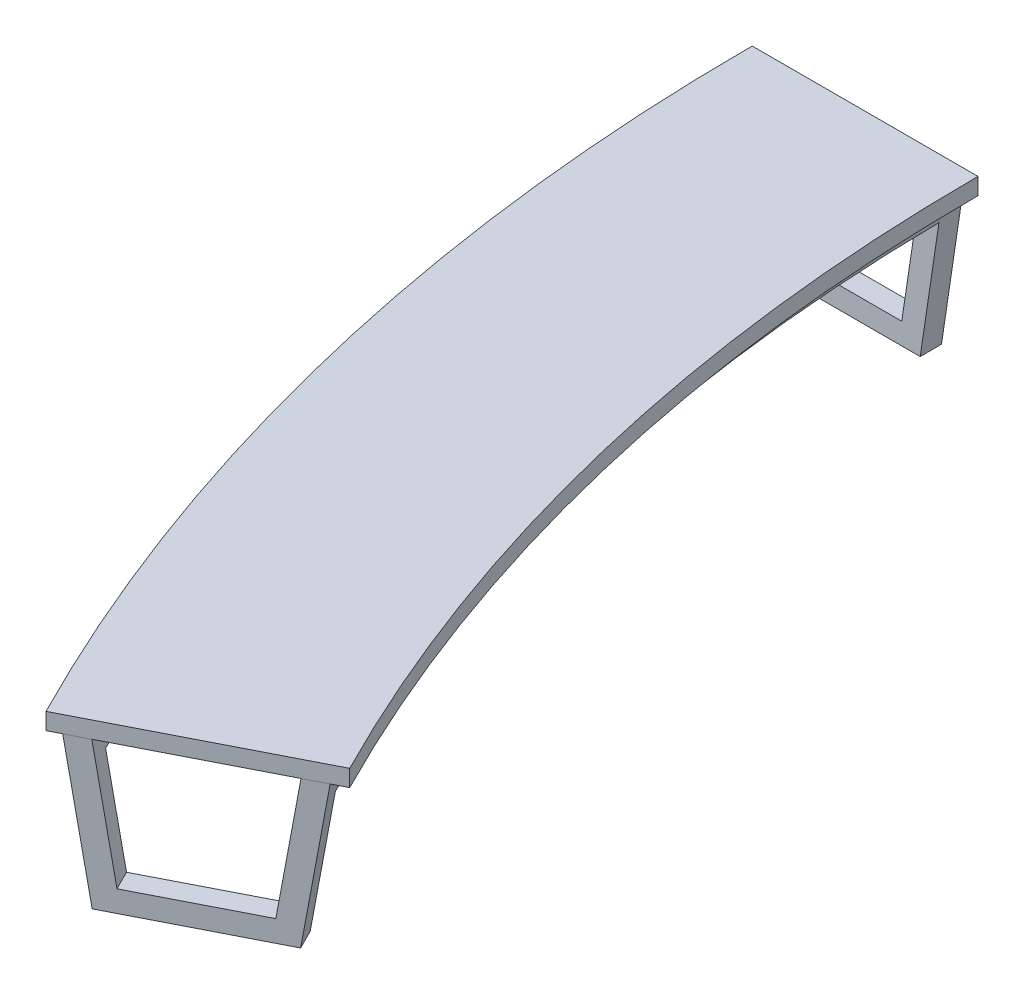
ISO-10303-21;
HEADER;
FILE_DESCRIPTION(('STEP AP214'),'2;1');
FILE_NAME('part.step','',(''),(''),'','','');
FILE_SCHEMA(('AUTOMOTIVE_DESIGN { 1 0 10303 214 1 1 1 1 }'));
ENDSEC;
DATA;
#1=APPLICATION_CONTEXT('core data for automotive mechanical design processes');
#2=APPLICATION_PROTOCOL_DEFINITION('international standard','automotive_design',2000,#1);
#3=PRODUCT_CONTEXT('',#1,'mechanical');
#4=PRODUCT('Part','Part','',(#3));
#5=PRODUCT_RELATED_PRODUCT_CATEGORY('part','',(#4));
#6=PRODUCT_DEFINITION_FORMATION('','',#4);
#7=PRODUCT_DEFINITION_CONTEXT('part definition',#1,'design');
#8=PRODUCT_DEFINITION('design','',#6,#7);
#9=PRODUCT_DEFINITION_SHAPE('','',#8);
#10=(LENGTH_UNIT() NAMED_UNIT(*) SI_UNIT(.MILLI.,.METRE.));
#11=(NAMED_UNIT(*) PLANE_ANGLE_UNIT() SI_UNIT($,.RADIAN.));
#12=(NAMED_UNIT(*) SI_UNIT($,.STERADIAN.) SOLID_ANGLE_UNIT());
#13=UNCERTAINTY_MEASURE_WITH_UNIT(LENGTH_MEASURE(1.E-05),#10,'distance_accuracy_value','');
#14=(GEOMETRIC_REPRESENTATION_CONTEXT(3) GLOBAL_UNCERTAINTY_ASSIGNED_CONTEXT((#13)) GLOBAL_UNIT_ASSIGNED_CONTEXT((#10,
#11,#12)) REPRESENTATION_CONTEXT('',''));
#15=CARTESIAN_POINT('',(0.,0.,0.));
#16=DIRECTION('',(0.,0.,1.));
#17=DIRECTION('',(1.,0.,0.));
#18=AXIS2_PLACEMENT_3D('',#15,#16,#17);
#19=CARTESIAN_POINT('',(0.,70.,0.));
#20=DIRECTION('',(0.,-1.,0.));
#21=DIRECTION('',(0.,0.,-1.));
#22=AXIS2_PLACEMENT_3D('',#19,#20,#21);
#23=CYLINDRICAL_SURFACE('',#22,6690.5465023735);
#24=CARTESIAN_POINT('',(0.,534.654813963416,0.));
#25=DIRECTION('',(0.,-1.,0.));
#26=DIRECTION('',(0.,0.,-1.));
#27=AXIS2_PLACEMENT_3D('',#24,#25,#26);
#28=CIRCLE('',#27,6690.5465023735);
#29=CARTESIAN_POINT('',(-5961.32058400045,534.654813963416,3037.44455014323));
#30=VERTEX_POINT('',#29);
#31=CARTESIAN_POINT('',(-6690.5465023735,534.654813963416,0.));
#32=VERTEX_POINT('',#31);
#33=EDGE_CURVE('E13',#30,#32,#28,.T.);
#34=ORIENTED_EDGE('',*,*,#33,.T.);
#35=DIRECTION('',(0.,1.,0.));
#36=VECTOR('',#35,1.);
#37=CARTESIAN_POINT('',(-6690.5465023735,479.999999999999,0.));
#38=LINE('',#37,#36);
#39=CARTESIAN_POINT('',(-6690.5465023735,479.999999999999,0.));
#40=VERTEX_POINT('',#39);
#41=EDGE_CURVE('E85',#40,#32,#38,.T.);
#42=ORIENTED_EDGE('',*,*,#41,.F.);
#43=CARTESIAN_POINT('',(0.,479.999999999999,0.));
#44=DIRECTION('',(0.,-1.,0.));
#45=DIRECTION('',(0.,0.,-1.));
#46=AXIS2_PLACEMENT_3D('',#43,#44,#45);
#47=CIRCLE('',#46,6690.5465023735);
#48=CARTESIAN_POINT('',(-5961.32058400045,479.999999999999,3037.44455014323));
#49=VERTEX_POINT('',#48);
#50=EDGE_CURVE('E60',#49,#40,#47,.T.);
#51=ORIENTED_EDGE('',*,*,#50,.F.);
#52=DIRECTION('',(0.,1.,0.));
#53=VECTOR('',#52,1.);
#54=CARTESIAN_POINT('',(-5961.32058400045,479.999999999999,3037.44455014323));
#55=LINE('',#54,#53);
#56=EDGE_CURVE('E87',#49,#30,#55,.T.);
#57=ORIENTED_EDGE('',*,*,#56,.T.);
#58=EDGE_LOOP('',(#34,#42,#51,#57));
#59=FACE_BOUND('',#58,.T.);
#60=ADVANCED_FACE('F45',(#59),#23,.T.);
#61=CARTESIAN_POINT('',(-5961.32058400045,534.654813963416,3037.44455014323));
#62=DIRECTION('',(0.,1.,0.));
#63=DIRECTION('',(0.,0.,1.));
#64=AXIS2_PLACEMENT_3D('',#61,#62,#63);
#65=PLANE('',#64);
#66=CARTESIAN_POINT('',(0.,534.654813963416,0.));
#67=DIRECTION('',(0.,-1.,0.));
#68=DIRECTION('',(0.,0.,-1.));
#69=AXIS2_PLACEMENT_3D('',#66,#67,#68);
#70=CIRCLE('',#69,5952.43896615089);
#71=CARTESIAN_POINT('',(-5303.6619536735,534.654813963416,2702.350740912));
#72=VERTEX_POINT('',#71);
#73=CARTESIAN_POINT('',(-5952.43896615089,534.654813963416,0.));
#74=VERTEX_POINT('',#73);
#75=EDGE_CURVE('E53',#72,#74,#70,.T.);
#76=ORIENTED_EDGE('',*,*,#75,.T.);
#77=DIRECTION('',(1.,0.,0.));
#78=VECTOR('',#77,1.);
#79=CARTESIAN_POINT('',(-6690.5465023735,534.654813963416,0.));
#80=LINE('',#79,#78);
#81=EDGE_CURVE('E96',#32,#74,#80,.T.);
#82=ORIENTED_EDGE('',*,*,#81,.F.);
#83=ORIENTED_EDGE('',*,*,#33,.F.);
#84=DIRECTION('',(0.891006524188367,0.,-0.453990499739548));
#85=VECTOR('',#84,1.);
#86=CARTESIAN_POINT('',(-5961.32058400045,534.654813963416,3037.44455014323));
#87=LINE('',#86,#85);
#88=EDGE_CURVE('E106',#30,#72,#87,.T.);
#89=ORIENTED_EDGE('',*,*,#88,.T.);
#90=EDGE_LOOP('',(#76,#82,#83,#89));
#91=FACE_BOUND('',#90,.T.);
#92=ADVANCED_FACE('F47',(#91),#65,.T.);
#93=CARTESIAN_POINT('',(0.,70.,0.));
#94=DIRECTION('',(0.,-1.,0.));
#95=DIRECTION('',(0.,0.,-1.));
#96=AXIS2_PLACEMENT_3D('',#93,#94,#95);
#97=CYLINDRICAL_SURFACE('',#96,5952.43896615089);
#98=CARTESIAN_POINT('',(0.,479.999999999999,0.));
#99=DIRECTION('',(0.,-1.,0.));
#100=DIRECTION('',(0.,0.,-1.));
#101=AXIS2_PLACEMENT_3D('',#98,#99,#100);
#102=CIRCLE('',#101,5952.43896615089);
#103=CARTESIAN_POINT('',(-5303.6619536735,479.999999999999,2702.350740912));
#104=VERTEX_POINT('',#103);
#105=CARTESIAN_POINT('',(-5952.43896615089,479.999999999999,0.));
#106=VERTEX_POINT('',#105);
#107=EDGE_CURVE('E68',#104,#106,#102,.T.);
#108=ORIENTED_EDGE('',*,*,#107,.T.);
#109=DIRECTION('',(0.,-1.,0.));
#110=VECTOR('',#109,1.);
#111=CARTESIAN_POINT('',(-5952.43896615089,479.999999999999,0.));
#112=LINE('',#111,#110);
#113=EDGE_CURVE('E100',#74,#106,#112,.T.);
#114=ORIENTED_EDGE('',*,*,#113,.F.);
#115=ORIENTED_EDGE('',*,*,#75,.F.);
#116=DIRECTION('',(0.,-1.,0.));
#117=VECTOR('',#116,1.);
#118=CARTESIAN_POINT('',(-5303.6619536735,479.999999999999,2702.350740912));
#119=LINE('',#118,#117);
#120=EDGE_CURVE('E108',#72,#104,#119,.T.);
#121=ORIENTED_EDGE('',*,*,#120,.T.);
#122=EDGE_LOOP('',(#108,#114,#115,#121));
#123=FACE_BOUND('',#122,.T.);
#124=ADVANCED_FACE('F114',(#123),#97,.F.);
#125=CARTESIAN_POINT('',(-5961.32058400045,479.999999999999,3037.44455014323));
#126=DIRECTION('',(0.,-1.,0.));
#127=DIRECTION('',(0.,0.,-1.));
#128=AXIS2_PLACEMENT_3D('',#125,#126,#127);
#129=PLANE('',#128);
#130=DIRECTION('',(-0.891006524188367,0.,0.453990499739548));
#131=VECTOR('',#130,1.);
#132=CARTESIAN_POINT('',(-5961.32058400045,479.999999999999,3037.44455014323));
#133=LINE('',#132,#131);
#134=EDGE_CURVE('E110',#104,#49,#133,.T.);
#135=ORIENTED_EDGE('',*,*,#134,.T.);
#136=ORIENTED_EDGE('',*,*,#50,.T.);
#137=DIRECTION('',(-1.,0.,0.));
#138=VECTOR('',#137,1.);
#139=CARTESIAN_POINT('',(-6690.5465023735,479.999999999999,0.));
#140=LINE('',#139,#138);
#141=EDGE_CURVE('E98',#106,#40,#140,.T.);
#142=ORIENTED_EDGE('',*,*,#141,.F.);
#143=ORIENTED_EDGE('',*,*,#107,.F.);
#144=EDGE_LOOP('',(#135,#136,#142,#143));
#145=FACE_BOUND('',#144,.T.);
#146=ADVANCED_FACE('F117',(#145),#129,.T.);
#147=CARTESIAN_POINT('',(0.,0.,0.));
#148=DIRECTION('',(-0.453990499739548,0.,-0.891006524188367));
#149=DIRECTION('',(-0.891006524188367,0.,0.453990499739548));
#150=AXIS2_PLACEMENT_3D('',#147,#148,#149);
#151=PLANE('',#150);
#152=ORIENTED_EDGE('',*,*,#56,.F.);
#153=ORIENTED_EDGE('',*,*,#134,.F.);
#154=ORIENTED_EDGE('',*,*,#120,.F.);
#155=ORIENTED_EDGE('',*,*,#88,.F.);
#156=EDGE_LOOP('',(#152,#153,#154,#155));
#157=FACE_BOUND('',#156,.T.);
#158=ADVANCED_FACE('F119',(#157),#151,.F.);
#159=CARTESIAN_POINT('',(0.,0.,0.));
#160=DIRECTION('',(0.,0.,-1.));
#161=DIRECTION('',(-1.,0.,0.));
#162=AXIS2_PLACEMENT_3D('',#159,#160,#161);
#163=PLANE('',#162);
#164=ORIENTED_EDGE('',*,*,#41,.T.);
#165=ORIENTED_EDGE('',*,*,#81,.T.);
#166=ORIENTED_EDGE('',*,*,#113,.T.);
#167=ORIENTED_EDGE('',*,*,#141,.T.);
#168=EDGE_LOOP('',(#164,#165,#166,#167));
#169=FACE_BOUND('',#168,.T.);
#170=ADVANCED_FACE('F94',(#169),#163,.T.);
#171=CLOSED_SHELL('',(#60,#92,#124,#146,#158,#170));
#172=MANIFOLD_SOLID_BREP('B2',#171);
#173=CARTESIAN_POINT('',(-5409.90779702268,-4.07413873219349E-13,2756.4857020014));
#174=DIRECTION('',(0.,1.,0.));
#175=DIRECTION('',(0.,0.,1.));
#176=AXIS2_PLACEMENT_3D('',#173,#174,#175);
#177=PLANE('',#176);
#178=DIRECTION('',(-0.891006524188367,0.,0.453990499739548));
#179=VECTOR('',#178,1.);
#180=CARTESIAN_POINT('',(-5441.68713200445,-4.07413873219349E-13,2694.11524530822));
#181=LINE('',#180,#179);
#182=CARTESIAN_POINT('',(-5441.3275876937,0.,2693.93204833166));
#183=VERTEX_POINT('',#182);
#184=CARTESIAN_POINT('',(-5892.77221699972,-7.33005636592722E-13,2923.95457600067));
#185=VERTEX_POINT('',#184);
#186=EDGE_CURVE('E347',#183,#185,#181,.T.);
#187=ORIENTED_EDGE('',*,*,#186,.F.);
#188=CARTESIAN_POINT('',(0.,0.,0.));
#189=DIRECTION('',(0.,-1.,0.));
#190=DIRECTION('',(0.,0.,-1.));
#191=AXIS2_PLACEMENT_3D('',#188,#189,#190);
#192=CIRCLE('',#191,6071.68146378126);
#193=CARTESIAN_POINT('',(-5409.90779702268,0.,2756.4857020014));
#194=VERTEX_POINT('',#193);
#195=EDGE_CURVE('E299',#194,#183,#192,.T.);
#196=ORIENTED_EDGE('',*,*,#195,.F.);
#197=DIRECTION('',(0.891006524188367,0.,-0.453990499739548));
#198=VECTOR('',#197,1.);
#199=CARTESIAN_POINT('',(-5409.90779702268,0.,2756.4857020014));
#200=LINE('',#199,#198);
#201=CARTESIAN_POINT('',(-5861.32473396016,-8.14390121432988E-13,2986.49411970387));
#202=VERTEX_POINT('',#201);
#203=EDGE_CURVE('E373',#202,#194,#200,.T.);
#204=ORIENTED_EDGE('',*,*,#203,.F.);
#205=CARTESIAN_POINT('',(0.,-8.14390121432988E-13,0.));
#206=DIRECTION('',(0.,-1.,0.));
#207=DIRECTION('',(0.,0.,-1.));
#208=AXIS2_PLACEMENT_3D('',#205,#206,#207);
#209=CIRCLE('',#208,6578.31853621874);
#210=EDGE_CURVE('E416',#202,#185,#209,.T.);
#211=ORIENTED_EDGE('',*,*,#210,.T.);
#212=EDGE_LOOP('',(#187,#196,#204,#211));
#213=FACE_BOUND('',#212,.T.);
#214=ADVANCED_FACE('F170',(#213),#177,.F.);
#215=CARTESIAN_POINT('',(-5807.57681766551,70.,2959.10818849445));
#216=DIRECTION('',(0.,-1.,0.));
#217=DIRECTION('',(0.,0.,-1.));
#218=AXIS2_PLACEMENT_3D('',#215,#216,#217);
#219=PLANE('',#218);
#220=CARTESIAN_POINT('',(0.,70.,0.));
#221=DIRECTION('',(0.,-1.,0.));
#222=DIRECTION('',(0.,0.,-1.));
#223=AXIS2_PLACEMENT_3D('',#220,#221,#222);
#224=CIRCLE('',#223,6132.00416045693);
#225=CARTESIAN_POINT('',(-5463.65571331734,70.,2783.87163321083));
#226=VERTEX_POINT('',#225);
#227=CARTESIAN_POINT('',(-5495.0790411847,70.,2721.31978183264));
#228=VERTEX_POINT('',#227);
#229=EDGE_CURVE('E404',#226,#228,#224,.T.);
#230=ORIENTED_EDGE('',*,*,#229,.T.);
#231=DIRECTION('',(0.891006524188367,0.,-0.453990499739548));
#232=VECTOR('',#231,1.);
#233=CARTESIAN_POINT('',(-5839.35615264728,70.,2896.73773180127));
#234=LINE('',#233,#232);
#235=CARTESIAN_POINT('',(-5839.021229308,70.,2896.56707983627));
#236=VERTEX_POINT('',#235);
#237=EDGE_CURVE('E43',#236,#228,#234,.T.);
#238=ORIENTED_EDGE('',*,*,#237,.F.);
#239=CARTESIAN_POINT('',(0.,70.,0.));
#240=DIRECTION('',(0.,-1.,0.));
#241=DIRECTION('',(0.,0.,-1.));
#242=AXIS2_PLACEMENT_3D('',#239,#240,#241);
#243=CIRCLE('',#242,6517.99583954307);
#244=CARTESIAN_POINT('',(-5807.57681766551,70.,2959.10818849445));
#245=VERTEX_POINT('',#244);
#246=EDGE_CURVE('E408',#245,#236,#243,.T.);
#247=ORIENTED_EDGE('',*,*,#246,.F.);
#248=DIRECTION('',(-0.891006524188367,0.,0.453990499739548));
#249=VECTOR('',#248,1.);
#250=CARTESIAN_POINT('',(-5807.57681766551,70.,2959.10818849445));
#251=LINE('',#250,#249);
#252=EDGE_CURVE('E385',#226,#245,#251,.T.);
#253=ORIENTED_EDGE('',*,*,#252,.F.);
#254=EDGE_LOOP('',(#230,#238,#247,#253));
#255=FACE_BOUND('',#254,.T.);
#256=ADVANCED_FACE('F448',(#255),#219,.F.);
#257=CARTESIAN_POINT('',(0.,480.,0.));
#258=DIRECTION('',(0.,-1.,0.));
#259=DIRECTION('',(0.,0.,-1.));
#260=AXIS2_PLACEMENT_3D('',#257,#258,#259);
#261=CONICAL_SURFACE('',#260,6070.7762434771,0.148240870210958);
#262=CARTESIAN_POINT('',(-1.38923304626977E-13,409.999999999998,0.));
#263=DIRECTION('',(0.,1.,0.));
#264=DIRECTION('',(-1.,0.,0.));
#265=AXIS2_PLACEMENT_3D('',#262,#263,#264);
#266=CIRCLE('',#265,6081.22979027853);
#267=CARTESIAN_POINT('',(-6080.82689789564,409.999999999999,70.));
#268=VERTEX_POINT('',#267);
#269=CARTESIAN_POINT('',(-5449.8357734669,409.999999999999,2698.26718551213));
#270=VERTEX_POINT('',#269);
#271=EDGE_CURVE('E469',#268,#270,#266,.T.);
#272=ORIENTED_EDGE('',*,*,#271,.T.);
#273=CARTESIAN_POINT('',(-5495.07906779838,69.9998,2721.31979539299));
#274=CARTESIAN_POINT('',(-5487.53851833744,126.666534008809,2717.47769353947));
#275=CARTESIAN_POINT('',(-5479.99796686154,183.333267679881,2713.63559065927));
#276=CARTESIAN_POINT('',(-5464.91685987981,296.666734346547,2705.95138284553));
#277=CARTESIAN_POINT('',(-5457.37630437398,353.333467342142,2702.10927791199));
#278=CARTESIAN_POINT('',(-5449.8357468532,410.000199999999,2698.26717195177));
#279=B_SPLINE_CURVE_WITH_KNOTS('',3,(#273,#274,#275,#276,#277,#278),.UNSPECIFIED.,.F.,.F.,(4,2,
4),(0.,171.885611336312,343.771222672623),.UNSPECIFIED.);
#280=EDGE_CURVE('E295',#228,#270,#279,.T.);
#281=ORIENTED_EDGE('',*,*,#280,.F.);
#282=ORIENTED_EDGE('',*,*,#229,.F.);
#283=DIRECTION('',(-0.13160034982642,-0.989032428976661,0.067053727398931));
#284=VECTOR('',#283,1.);
#285=CARTESIAN_POINT('',(-5463.65571331734,70.,2783.87163321083));
#286=LINE('',#285,#284);
#287=CARTESIAN_POINT('',(-5409.10123982585,480.,2756.07474058314));
#288=VERTEX_POINT('',#287);
#289=EDGE_CURVE('E382',#288,#226,#286,.T.);
#290=ORIENTED_EDGE('',*,*,#289,.F.);
#291=CARTESIAN_POINT('',(0.,480.,0.));
#292=DIRECTION('',(0.,-1.,0.));
#293=DIRECTION('',(0.,0.,-1.));
#294=AXIS2_PLACEMENT_3D('',#291,#292,#293);
#295=CIRCLE('',#294,6070.7762434771);
#296=CARTESIAN_POINT('',(-6070.7762434771,480.,0.));
#297=VERTEX_POINT('',#296);
#298=EDGE_CURVE('E401',#288,#297,#295,.T.);
#299=ORIENTED_EDGE('',*,*,#298,.T.);
#300=DIRECTION('',(-0.147698525492052,-0.989032428976661,0.));
#301=VECTOR('',#300,1.);
#302=CARTESIAN_POINT('',(-6132.00416045693,70.,0.));
#303=LINE('',#302,#301);
#304=CARTESIAN_POINT('',(-6132.00416045693,70.,0.));
#305=VERTEX_POINT('',#304);
#306=EDGE_CURVE('E358',#297,#305,#303,.T.);
#307=ORIENTED_EDGE('',*,*,#306,.T.);
#308=CARTESIAN_POINT('',(-6131.60460433165,70.,70.));
#309=VERTEX_POINT('',#308);
#310=EDGE_CURVE('E403',#309,#305,#224,.T.);
#311=ORIENTED_EDGE('',*,*,#310,.F.);
#312=CARTESIAN_POINT('',(-6254.92883127513,-755.762264265028,70.));
#313=CARTESIAN_POINT('',(-6211.43624614379,-464.541441065771,70.));
#314=CARTESIAN_POINT('',(-6167.94360179102,-173.320626711006,70.));
#315=CARTESIAN_POINT('',(-6080.95819464261,409.120984309538,70.));
#316=CARTESIAN_POINT('',(-6037.46543184698,700.341780975318,70.));
#317=CARTESIAN_POINT('',(-5993.97260982991,991.562568796605,70.));
#318=B_SPLINE_CURVE_WITH_KNOTS('',3,(#312,#313,#314,#315,#316,#317),.UNSPECIFIED.,.F.,.F.,(4,2,
4),(0.,883.351886530073,1766.70377306015),.UNSPECIFIED.);
#319=EDGE_CURVE('E509',#309,#268,#318,.T.);
#320=ORIENTED_EDGE('',*,*,#319,.T.);
#321=EDGE_LOOP('',(#272,#281,#282,#290,#299,#307,#311,#320));
#322=FACE_BOUND('',#321,.T.);
#323=ADVANCED_FACE('F442',(#322),#261,.T.);
#324=CARTESIAN_POINT('',(0.,0.,0.));
#325=DIRECTION('',(0.,-1.,0.));
#326=DIRECTION('',(0.,0.,-1.));
#327=AXIS2_PLACEMENT_3D('',#324,#325,#326);
#328=CONICAL_SURFACE('',#327,6071.68146378126,0.148240870210959);
#329=CARTESIAN_POINT('',(-5386.7694246977,410.000199999999,2666.13327580753));
#330=CARTESIAN_POINT('',(-5395.86246235235,341.66680101458,2670.76640990579));
#331=CARTESIAN_POINT('',(-5404.95549698048,273.333401521871,2675.39954246196));
#332=CARTESIAN_POINT('',(-5423.14156018372,136.666601521871,2684.66580449012));
#333=CARTESIAN_POINT('',(-5432.23458875882,68.333201014581,2689.29893396211));
#334=CARTESIAN_POINT('',(-5441.32761430741,-0.000199999999995033,2693.93206189202));
#335=B_SPLINE_CURVE_WITH_KNOTS('',3,(#329,#330,#331,#332,#333,#334),.UNSPECIFIED.,.F.,.F.,(4,2,
4),(0.,207.273790288003,414.547580576006),.UNSPECIFIED.);
#336=CARTESIAN_POINT('',(-5386.76945131144,409.999999999999,2666.13328936791));
#337=VERTEX_POINT('',#336);
#338=EDGE_CURVE('E292',#337,#183,#335,.T.);
#339=ORIENTED_EDGE('',*,*,#338,.F.);
#340=CARTESIAN_POINT('',(0.,409.999999999998,0.));
#341=DIRECTION('',(0.,1.,0.));
#342=DIRECTION('',(-1.,0.,0.));
#343=AXIS2_PLACEMENT_3D('',#340,#341,#342);
#344=CIRCLE('',#343,6010.45354680143);
#345=CARTESIAN_POINT('',(-6010.04590982947,409.999999999999,70.));
#346=VERTEX_POINT('',#345);
#347=EDGE_CURVE('E179',#337,#346,#344,.F.);
#348=ORIENTED_EDGE('',*,*,#347,.T.);
#349=CARTESIAN_POINT('',(-5920.09900689596,1012.26924079778,70.));
#350=CARTESIAN_POINT('',(-5967.47319926472,695.059973590648,70.));
#351=CARTESIAN_POINT('',(-6014.84731917761,377.850695562501,70.));
#352=CARTESIAN_POINT('',(-6109.59541409164,-256.567882135831,70.));
#353=CARTESIAN_POINT('',(-6156.96938909278,-573.777181806016,70.));
#354=CARTESIAN_POINT('',(-6204.34329163806,-890.986492297221,70.));
#355=B_SPLINE_CURVE_WITH_KNOTS('',3,(#349,#350,#351,#352,#353,#354),.UNSPECIFIED.,.F.,.F.,(4,2,
4),(0.,962.182051247024,1924.36410249405),.UNSPECIFIED.);
#356=CARTESIAN_POINT('',(-6071.27793776771,0.,70.));
#357=VERTEX_POINT('',#356);
#358=EDGE_CURVE('E287',#346,#357,#355,.T.);
#359=ORIENTED_EDGE('',*,*,#358,.T.);
#360=CARTESIAN_POINT('',(-6071.68146378126,0.,0.));
#361=VERTEX_POINT('',#360);
#362=EDGE_CURVE('E397',#357,#361,#192,.T.);
#363=ORIENTED_EDGE('',*,*,#362,.T.);
#364=DIRECTION('',(0.147698525492053,0.989032428976661,0.));
#365=VECTOR('',#364,1.);
#366=CARTESIAN_POINT('',(-6000.,479.999999999999,0.));
#367=LINE('',#366,#365);
#368=CARTESIAN_POINT('',(-6000.,479.999999999999,0.));
#369=VERTEX_POINT('',#368);
#370=EDGE_CURVE('E352',#361,#369,#367,.T.);
#371=ORIENTED_EDGE('',*,*,#370,.T.);
#372=CARTESIAN_POINT('',(0.,479.999999999999,0.));
#373=DIRECTION('',(0.,-1.,0.));
#374=DIRECTION('',(0.,0.,-1.));
#375=AXIS2_PLACEMENT_3D('',#372,#373,#374);
#376=CIRCLE('',#375,6000.);
#377=CARTESIAN_POINT('',(-5346.0391451302,479.999999999999,2723.94299843729));
#378=VERTEX_POINT('',#377);
#379=EDGE_CURVE('E399',#378,#369,#376,.T.);
#380=ORIENTED_EDGE('',*,*,#379,.F.);
#381=DIRECTION('',(0.131600349826421,0.989032428976661,-0.0670537273989313));
#382=VECTOR('',#381,1.);
#383=CARTESIAN_POINT('',(-5346.0391451302,479.999999999999,2723.94299843729));
#384=LINE('',#383,#382);
#385=EDGE_CURVE('E376',#194,#378,#384,.T.);
#386=ORIENTED_EDGE('',*,*,#385,.F.);
#387=ORIENTED_EDGE('',*,*,#195,.T.);
#388=EDGE_LOOP('',(#339,#348,#359,#363,#371,#380,#386,#387));
#389=FACE_BOUND('',#388,.T.);
#390=ADVANCED_FACE('F297',(#389),#328,.F.);
#391=ORIENTED_EDGE('',*,*,#362,.F.);
#392=DIRECTION('',(-1.,0.,0.));
#393=VECTOR('',#392,1.);
#394=CARTESIAN_POINT('',(-5409.90779702268,-4.07413873219349E-13,69.9999999999998));
#395=LINE('',#394,#393);
#396=CARTESIAN_POINT('',(-6577.94609007698,-8.14390121432988E-13,69.9999999999998));
#397=VERTEX_POINT('',#396);
#398=EDGE_CURVE('E192',#357,#397,#395,.T.);
#399=ORIENTED_EDGE('',*,*,#398,.T.);
#400=CARTESIAN_POINT('',(-6578.31853621874,-8.14390121432988E-13,0.));
#401=VERTEX_POINT('',#400);
#402=EDGE_CURVE('E415',#397,#401,#209,.T.);
#403=ORIENTED_EDGE('',*,*,#402,.T.);
#404=DIRECTION('',(1.,0.,0.));
#405=VECTOR('',#404,1.);
#406=CARTESIAN_POINT('',(-6071.68146378126,0.,0.));
#407=LINE('',#406,#405);
#408=EDGE_CURVE('E349',#401,#361,#407,.T.);
#409=ORIENTED_EDGE('',*,*,#408,.T.);
#410=EDGE_LOOP('',(#391,#399,#403,#409));
#411=FACE_BOUND('',#410,.T.);
#412=ADVANCED_FACE('F426',(#411),#177,.F.);
#413=CARTESIAN_POINT('',(-6517.6199462918,70.,69.9999999999998));
#414=VERTEX_POINT('',#413);
#415=CARTESIAN_POINT('',(-6517.99583954307,70.,0.));
#416=VERTEX_POINT('',#415);
#417=EDGE_CURVE('E407',#414,#416,#243,.T.);
#418=ORIENTED_EDGE('',*,*,#417,.F.);
#419=DIRECTION('',(1.,0.,0.));
#420=VECTOR('',#419,1.);
#421=CARTESIAN_POINT('',(-5807.57681766551,70.,69.9999999999998));
#422=LINE('',#421,#420);
#423=EDGE_CURVE('E480',#414,#309,#422,.T.);
#424=ORIENTED_EDGE('',*,*,#423,.T.);
#425=ORIENTED_EDGE('',*,*,#310,.T.);
#426=DIRECTION('',(-1.,0.,0.));
#427=VECTOR('',#426,1.);
#428=CARTESIAN_POINT('',(-6517.99583954307,70.,0.));
#429=LINE('',#428,#427);
#430=EDGE_CURVE('E361',#305,#416,#429,.T.);
#431=ORIENTED_EDGE('',*,*,#430,.T.);
#432=EDGE_LOOP('',(#418,#424,#425,#431));
#433=FACE_BOUND('',#432,.T.);
#434=ADVANCED_FACE('F490',(#433),#219,.F.);
#435=CARTESIAN_POINT('',(0.,479.999999999999,0.));
#436=DIRECTION('',(0.,1.,0.));
#437=DIRECTION('',(0.,0.,1.));
#438=AXIS2_PLACEMENT_3D('',#435,#436,#437);
#439=CONICAL_SURFACE('',#438,6650.,0.148240870210959);
#440=ORIENTED_EDGE('',*,*,#402,.F.);
#441=CARTESIAN_POINT('',(-6332.32374179869,-1644.66218964988,70.));
#442=CARTESIAN_POINT('',(-6418.99639511001,-1064.31216179524,70.));
#443=CARTESIAN_POINT('',(-6505.6688596327,-483.962105745999,70.));
#444=CARTESIAN_POINT('',(-6679.01341110081,676.738062741691,70.));
#445=CARTESIAN_POINT('',(-6765.68549804623,1257.08817518014,70.));
#446=CARTESIAN_POINT('',(-6852.35739620301,1837.43831581319,70.));
#447=B_SPLINE_CURVE_WITH_KNOTS('',3,(#441,#442,#443,#444,#445,#446),.UNSPECIFIED.,.F.,.F.,(4,2,
4),(0.,1760.35926247036,3520.7185249407),.UNSPECIFIED.);
#448=CARTESIAN_POINT('',(-6639.17744183582,409.999999999999,70.));
#449=VERTEX_POINT('',#448);
#450=EDGE_CURVE('E464',#397,#449,#447,.T.);
#451=ORIENTED_EDGE('',*,*,#450,.T.);
#452=CARTESIAN_POINT('',(-1.31418401617334E-13,409.999999999998,0.));
#453=DIRECTION('',(0.,1.,0.));
#454=DIRECTION('',(-1.,0.,0.));
#455=AXIS2_PLACEMENT_3D('',#452,#453,#454);
#456=CIRCLE('',#455,6639.54645319857);
#457=CARTESIAN_POINT('',(-5947.32975090172,409.999999999999,2951.75302798539));
#458=VERTEX_POINT('',#457);
#459=EDGE_CURVE('E463',#449,#458,#456,.T.);
#460=ORIENTED_EDGE('',*,*,#459,.T.);
#461=CARTESIAN_POINT('',(-5892.77219038627,-0.00020000000081439,2923.95456244044));
#462=CARTESIAN_POINT('',(-5901.86512619721,68.3331992251573,2928.58764464673));
#463=CARTESIAN_POINT('',(-5910.95805969674,136.666598837736,2933.2207256753));
#464=CARTESIAN_POINT('',(-5929.14392207303,273.333398837736,2942.48688537703));
#465=CARTESIAN_POINT('',(-5938.23685094978,341.666799225157,2947.11996405017));
#466=CARTESIAN_POINT('',(-5947.32977751514,410.000199999999,2951.7530415456));
#467=B_SPLINE_CURVE_WITH_KNOTS('',3,(#461,#462,#463,#464,#465,#466),.UNSPECIFIED.,.F.,.F.,(4,2,
4),(0.,207.273740349594,414.547480699188),.UNSPECIFIED.);
#468=EDGE_CURVE('E340',#185,#458,#467,.T.);
#469=ORIENTED_EDGE('',*,*,#468,.F.);
#470=ORIENTED_EDGE('',*,*,#210,.F.);
#471=DIRECTION('',(0.131600349826421,-0.989032428976661,-0.0670537273989312));
#472=VECTOR('',#471,1.);
#473=CARTESIAN_POINT('',(-5861.32473396016,-8.14390121432988E-13,2986.49411970387));
#474=LINE('',#473,#472);
#475=CARTESIAN_POINT('',(-5925.19338585264,479.999999999999,3019.03682326799));
#476=VERTEX_POINT('',#475);
#477=EDGE_CURVE('E394',#476,#202,#474,.T.);
#478=ORIENTED_EDGE('',*,*,#477,.F.);
#479=CARTESIAN_POINT('',(0.,479.999999999999,0.));
#480=DIRECTION('',(0.,-1.,0.));
#481=DIRECTION('',(0.,0.,-1.));
#482=AXIS2_PLACEMENT_3D('',#479,#480,#481);
#483=CIRCLE('',#482,6650.);
#484=CARTESIAN_POINT('',(-6650.,479.999999999999,0.));
#485=VERTEX_POINT('',#484);
#486=EDGE_CURVE('E413',#476,#485,#483,.T.);
#487=ORIENTED_EDGE('',*,*,#486,.T.);
#488=DIRECTION('',(0.147698525492052,-0.989032428976661,0.));
#489=VECTOR('',#488,1.);
#490=CARTESIAN_POINT('',(-6578.31853621874,-8.14390121432988E-13,0.));
#491=LINE('',#490,#489);
#492=EDGE_CURVE('E370',#485,#401,#491,.T.);
#493=ORIENTED_EDGE('',*,*,#492,.T.);
#494=EDGE_LOOP('',(#440,#451,#460,#469,#470,#478,#487,#493));
#495=FACE_BOUND('',#494,.T.);
#496=ADVANCED_FACE('F172',(#495),#439,.T.);
#497=CARTESIAN_POINT('',(-5925.19338585264,480.,3019.03682326799));
#498=DIRECTION('',(0.,-1.,0.));
#499=DIRECTION('',(0.,0.,-1.));
#500=AXIS2_PLACEMENT_3D('',#497,#498,#499);
#501=PLANE('',#500);
#502=CARTESIAN_POINT('',(0.,480.,0.));
#503=DIRECTION('',(0.,-1.,0.));
#504=DIRECTION('',(0.,0.,-1.));
#505=AXIS2_PLACEMENT_3D('',#502,#503,#504);
#506=CIRCLE('',#505,6579.2237565229);
#507=CARTESIAN_POINT('',(-5862.131291157,480.,2986.90508112214));
#508=VERTEX_POINT('',#507);
#509=CARTESIAN_POINT('',(-6579.2237565229,480.,0.));
#510=VERTEX_POINT('',#509);
#511=EDGE_CURVE('E411',#508,#510,#506,.T.);
#512=ORIENTED_EDGE('',*,*,#511,.T.);
#513=DIRECTION('',(-1.,0.,0.));
#514=VECTOR('',#513,1.);
#515=CARTESIAN_POINT('',(-6650.,479.999999999999,0.));
#516=LINE('',#515,#514);
#517=EDGE_CURVE('E367',#510,#485,#516,.T.);
#518=ORIENTED_EDGE('',*,*,#517,.T.);
#519=ORIENTED_EDGE('',*,*,#486,.F.);
#520=DIRECTION('',(-0.891006524188367,0.,0.453990499739548));
#521=VECTOR('',#520,1.);
#522=CARTESIAN_POINT('',(-5925.19338585264,479.999999999999,3019.03682326799));
#523=LINE('',#522,#521);
#524=EDGE_CURVE('E391',#508,#476,#523,.T.);
#525=ORIENTED_EDGE('',*,*,#524,.F.);
#526=EDGE_LOOP('',(#512,#518,#519,#525));
#527=FACE_BOUND('',#526,.T.);
#528=ADVANCED_FACE('F456',(#527),#501,.F.);
#529=CARTESIAN_POINT('',(0.,70.,0.));
#530=DIRECTION('',(0.,1.,0.));
#531=DIRECTION('',(0.,0.,1.));
#532=AXIS2_PLACEMENT_3D('',#529,#530,#531);
#533=CONICAL_SURFACE('',#532,6517.99583954307,0.148240870210956);
#534=CARTESIAN_POINT('',(-1.30017507617146E-13,409.999999999998,0.));
#535=DIRECTION('',(0.,1.,0.));
#536=DIRECTION('',(-1.,0.,0.));
#537=AXIS2_PLACEMENT_3D('',#534,#535,#536);
#538=CIRCLE('',#537,6568.77020972147);
#539=CARTESIAN_POINT('',(-5884.26411339013,409.999999999999,2919.61948068464));
#540=VERTEX_POINT('',#539);
#541=CARTESIAN_POINT('',(-6568.39722216342,409.999999999999,70.));
#542=VERTEX_POINT('',#541);
#543=EDGE_CURVE('E468',#540,#542,#538,.F.);
#544=ORIENTED_EDGE('',*,*,#543,.T.);
#545=CARTESIAN_POINT('',(-6778.4451580646,1816.46488471432,70.));
#546=CARTESIAN_POINT('',(-6695.38926202323,1260.32793065955,70.));
#547=CARTESIAN_POINT('',(-6612.33318756345,704.191003250668,70.));
#548=CARTESIAN_POINT('',(-6446.22068180706,-408.082798275308,70.));
#549=CARTESIAN_POINT('',(-6363.16425051045,-964.219672392405,70.));
#550=CARTESIAN_POINT('',(-6280.10764079543,-1520.35651986361,70.));
#551=B_SPLINE_CURVE_WITH_KNOTS('',3,(#545,#546,#547,#548,#549,#550),.UNSPECIFIED.,.F.,.F.,(4,2,
4),(0.,1686.91414772422,3373.82829544845),.UNSPECIFIED.);
#552=EDGE_CURVE('E473',#542,#414,#551,.T.);
#553=ORIENTED_EDGE('',*,*,#552,.T.);
#554=ORIENTED_EDGE('',*,*,#417,.T.);
#555=DIRECTION('',(-0.147698525492052,0.989032428976661,0.));
#556=VECTOR('',#555,1.);
#557=CARTESIAN_POINT('',(-6579.2237565229,480.,0.));
#558=LINE('',#557,#556);
#559=EDGE_CURVE('E364',#416,#510,#558,.T.);
#560=ORIENTED_EDGE('',*,*,#559,.T.);
#561=ORIENTED_EDGE('',*,*,#511,.F.);
#562=DIRECTION('',(-0.13160034982642,0.989032428976661,0.067053727398931));
#563=VECTOR('',#562,1.);
#564=CARTESIAN_POINT('',(-5862.131291157,480.,2986.90508112214));
#565=LINE('',#564,#563);
#566=EDGE_CURVE('E388',#245,#508,#565,.T.);
#567=ORIENTED_EDGE('',*,*,#566,.F.);
#568=ORIENTED_EDGE('',*,*,#246,.T.);
#569=CARTESIAN_POINT('',(-5884.26414000358,410.000199999999,2919.61949424487));
#570=CARTESIAN_POINT('',(-5876.72365372759,353.333466117644,2915.77742458569));
#571=CARTESIAN_POINT('',(-5869.18316581384,296.6667325098,2911.93535409203));
#572=CARTESIAN_POINT('',(-5854.10218671082,183.333265843134,2904.25121143575));
#573=CARTESIAN_POINT('',(-5846.56169552156,126.666532784311,2900.40913927313));
#574=CARTESIAN_POINT('',(-5839.02120269453,69.9997999999999,2896.56706627603));
#575=B_SPLINE_CURVE_WITH_KNOTS('',3,(#569,#570,#571,#572,#573,#574),.UNSPECIFIED.,.F.,.F.,(4,2,
4),(0.,171.8855795375,343.771159075),.UNSPECIFIED.);
#576=EDGE_CURVE('E332',#540,#236,#575,.T.);
#577=ORIENTED_EDGE('',*,*,#576,.F.);
#578=EDGE_LOOP('',(#544,#553,#554,#560,#561,#567,#568,#577));
#579=FACE_BOUND('',#578,.T.);
#580=ADVANCED_FACE('F452',(#579),#533,.F.);
#581=CARTESIAN_POINT('',(-5409.10123982585,480.,2756.07474058314));
#582=DIRECTION('',(0.,-1.,0.));
#583=DIRECTION('',(0.,0.,-1.));
#584=AXIS2_PLACEMENT_3D('',#581,#582,#583);
#585=PLANE('',#584);
#586=ORIENTED_EDGE('',*,*,#379,.T.);
#587=DIRECTION('',(-1.,0.,0.));
#588=VECTOR('',#587,1.);
#589=CARTESIAN_POINT('',(-6070.7762434771,480.,0.));
#590=LINE('',#589,#588);
#591=EDGE_CURVE('E355',#369,#297,#590,.T.);
#592=ORIENTED_EDGE('',*,*,#591,.T.);
#593=ORIENTED_EDGE('',*,*,#298,.F.);
#594=DIRECTION('',(-0.891006524188367,0.,0.453990499739548));
#595=VECTOR('',#594,1.);
#596=CARTESIAN_POINT('',(-5409.10123982585,480.,2756.07474058314));
#597=LINE('',#596,#595);
#598=EDGE_CURVE('E379',#378,#288,#597,.T.);
#599=ORIENTED_EDGE('',*,*,#598,.F.);
#600=EDGE_LOOP('',(#586,#592,#593,#599));
#601=FACE_BOUND('',#600,.T.);
#602=ADVANCED_FACE('F440',(#601),#585,.F.);
#603=CARTESIAN_POINT('',(0.,0.,0.));
#604=DIRECTION('',(-0.453990499739548,0.,-0.891006524188367));
#605=DIRECTION('',(-0.891006524188367,0.,0.453990499739548));
#606=AXIS2_PLACEMENT_3D('',#603,#604,#605);
#607=PLANE('',#606);
#608=ORIENTED_EDGE('',*,*,#203,.T.);
#609=ORIENTED_EDGE('',*,*,#385,.T.);
#610=ORIENTED_EDGE('',*,*,#598,.T.);
#611=ORIENTED_EDGE('',*,*,#289,.T.);
#612=ORIENTED_EDGE('',*,*,#252,.T.);
#613=ORIENTED_EDGE('',*,*,#566,.T.);
#614=ORIENTED_EDGE('',*,*,#524,.T.);
#615=ORIENTED_EDGE('',*,*,#477,.T.);
#616=EDGE_LOOP('',(#608,#609,#610,#611,#612,#613,#614,#615));
#617=FACE_BOUND('',#616,.T.);
#618=ADVANCED_FACE('F437',(#617),#607,.F.);
#619=CARTESIAN_POINT('',(0.,0.,0.));
#620=DIRECTION('',(0.,0.,-1.));
#621=DIRECTION('',(-1.,0.,0.));
#622=AXIS2_PLACEMENT_3D('',#619,#620,#621);
#623=PLANE('',#622);
#624=ORIENTED_EDGE('',*,*,#408,.F.);
#625=ORIENTED_EDGE('',*,*,#492,.F.);
#626=ORIENTED_EDGE('',*,*,#517,.F.);
#627=ORIENTED_EDGE('',*,*,#559,.F.);
#628=ORIENTED_EDGE('',*,*,#430,.F.);
#629=ORIENTED_EDGE('',*,*,#306,.F.);
#630=ORIENTED_EDGE('',*,*,#591,.F.);
#631=ORIENTED_EDGE('',*,*,#370,.F.);
#632=EDGE_LOOP('',(#624,#625,#626,#627,#628,#629,#630,#631));
#633=FACE_BOUND('',#632,.T.);
#634=ADVANCED_FACE('F326',(#633),#623,.T.);
#635=CARTESIAN_POINT('',(-31.7793349817683,0.,-62.3704566931857));
#636=DIRECTION('',(-0.453990499739548,0.,-0.891006524188367));
#637=DIRECTION('',(-0.891006524188367,0.,0.453990499739548));
#638=AXIS2_PLACEMENT_3D('',#635,#636,#637);
#639=PLANE('',#638);
#640=ORIENTED_EDGE('',*,*,#186,.T.);
#641=ORIENTED_EDGE('',*,*,#468,.T.);
#642=DIRECTION('',(-0.891006524188367,0.,0.453990499739548));
#643=VECTOR('',#642,1.);
#644=CARTESIAN_POINT('',(-7542.3193602394,409.999999999999,3764.44082562212));
#645=LINE('',#644,#643);
#646=EDGE_CURVE('E521',#540,#458,#645,.T.);
#647=ORIENTED_EDGE('',*,*,#646,.F.);
#648=ORIENTED_EDGE('',*,*,#576,.T.);
#649=ORIENTED_EDGE('',*,*,#237,.T.);
#650=ORIENTED_EDGE('',*,*,#280,.T.);
#651=DIRECTION('',(-0.891006524188371,0.,0.453990499739541));
#652=VECTOR('',#651,1.);
#653=CARTESIAN_POINT('',(-2810.96366727871,409.999999999999,1353.6946894483));
#654=LINE('',#653,#652);
#655=EDGE_CURVE('E284',#337,#270,#654,.T.);
#656=ORIENTED_EDGE('',*,*,#655,.F.);
#657=ORIENTED_EDGE('',*,*,#338,.T.);
#658=EDGE_LOOP('',(#640,#641,#647,#648,#649,#650,#656,#657));
#659=FACE_BOUND('',#658,.T.);
#660=ADVANCED_FACE('F291',(#659),#639,.T.);
#661=CARTESIAN_POINT('',(-7038.76977104693,409.999999999999,4752.71253941406));
#662=DIRECTION('',(0.,1.,0.));
#663=DIRECTION('',(-1.,0.,0.));
#664=AXIS2_PLACEMENT_3D('',#661,#662,#663);
#665=PLANE('',#664);
#666=ORIENTED_EDGE('',*,*,#646,.T.);
#667=ORIENTED_EDGE('',*,*,#459,.F.);
#668=DIRECTION('',(1.,0.,0.));
#669=VECTOR('',#668,1.);
#670=CARTESIAN_POINT('',(-7038.76977104693,409.999999999999,70.));
#671=LINE('',#670,#669);
#672=EDGE_CURVE('E301',#449,#542,#671,.T.);
#673=ORIENTED_EDGE('',*,*,#672,.T.);
#674=ORIENTED_EDGE('',*,*,#543,.F.);
#675=EDGE_LOOP('',(#666,#667,#673,#674));
#676=FACE_BOUND('',#675,.T.);
#677=ADVANCED_FACE('F325',(#676),#665,.F.);
#678=EDGE_CURVE('E186',#268,#346,#671,.T.);
#679=ORIENTED_EDGE('',*,*,#678,.T.);
#680=ORIENTED_EDGE('',*,*,#347,.F.);
#681=ORIENTED_EDGE('',*,*,#655,.T.);
#682=ORIENTED_EDGE('',*,*,#271,.F.);
#683=EDGE_LOOP('',(#679,#680,#681,#682));
#684=FACE_BOUND('',#683,.T.);
#685=ADVANCED_FACE('F283',(#684),#665,.F.);
#686=CARTESIAN_POINT('',(0.,0.,70.));
#687=DIRECTION('',(0.,0.,-1.));
#688=DIRECTION('',(-1.,0.,0.));
#689=AXIS2_PLACEMENT_3D('',#686,#687,#688);
#690=PLANE('',#689);
#691=ORIENTED_EDGE('',*,*,#672,.F.);
#692=ORIENTED_EDGE('',*,*,#450,.F.);
#693=ORIENTED_EDGE('',*,*,#398,.F.);
#694=ORIENTED_EDGE('',*,*,#358,.F.);
#695=ORIENTED_EDGE('',*,*,#678,.F.);
#696=ORIENTED_EDGE('',*,*,#319,.F.);
#697=ORIENTED_EDGE('',*,*,#423,.F.);
#698=ORIENTED_EDGE('',*,*,#552,.F.);
#699=EDGE_LOOP('',(#691,#692,#693,#694,#695,#696,#697,#698));
#700=FACE_BOUND('',#699,.T.);
#701=ADVANCED_FACE('F327',(#700),#690,.F.);
#702=CLOSED_SHELL('',(#214,#256,#323,#390,#412,#434,#496,#528,#580,#602,#618,#634,#660,#677,
#685,#701));
#703=MANIFOLD_SOLID_BREP('B7',#702);
#704=ADVANCED_BREP_SHAPE_REPRESENTATION('',(#18,#172,#703),#14);
#705=SHAPE_DEFINITION_REPRESENTATION(#9,#704);
ENDSEC;
END-ISO-10303-21;
